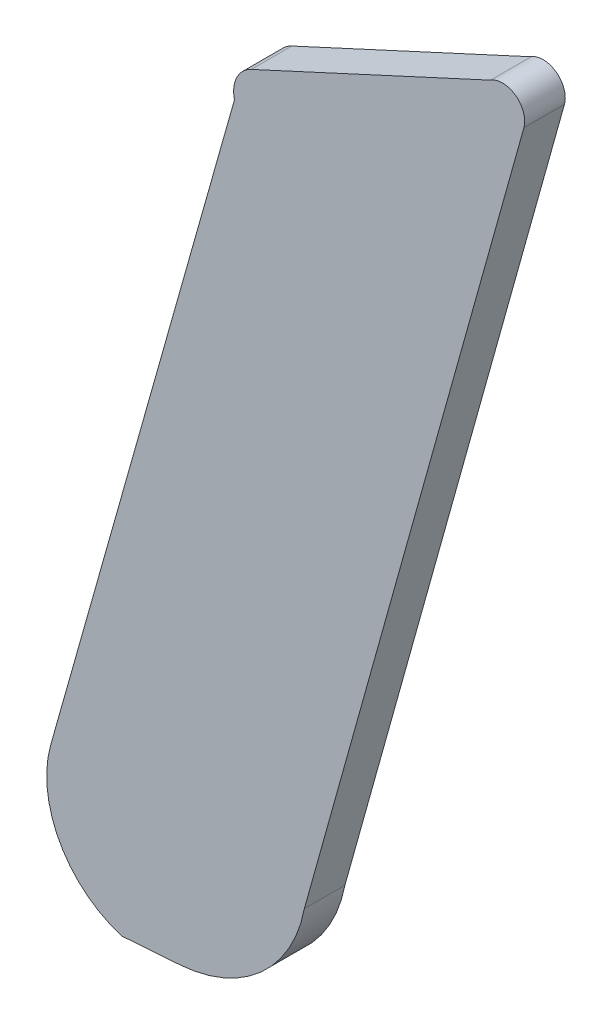
ISO-10303-21;
HEADER;
FILE_DESCRIPTION(('STEP AP214'),'2;1');
FILE_NAME('part.step','',(''),(''),'','','');
FILE_SCHEMA(('AUTOMOTIVE_DESIGN { 1 0 10303 214 1 1 1 1 }'));
ENDSEC;
DATA;
#1=APPLICATION_CONTEXT('core data for automotive mechanical design processes');
#2=APPLICATION_PROTOCOL_DEFINITION('international standard','automotive_design',2000,#1);
#3=PRODUCT_CONTEXT('',#1,'mechanical');
#4=PRODUCT('Part','Part','',(#3));
#5=PRODUCT_RELATED_PRODUCT_CATEGORY('part','',(#4));
#6=PRODUCT_DEFINITION_FORMATION('','',#4);
#7=PRODUCT_DEFINITION_CONTEXT('part definition',#1,'design');
#8=PRODUCT_DEFINITION('design','',#6,#7);
#9=PRODUCT_DEFINITION_SHAPE('','',#8);
#10=(LENGTH_UNIT() NAMED_UNIT(*) SI_UNIT(.MILLI.,.METRE.));
#11=(NAMED_UNIT(*) PLANE_ANGLE_UNIT() SI_UNIT($,.RADIAN.));
#12=(NAMED_UNIT(*) SI_UNIT($,.STERADIAN.) SOLID_ANGLE_UNIT());
#13=UNCERTAINTY_MEASURE_WITH_UNIT(LENGTH_MEASURE(1.E-05),#10,'distance_accuracy_value','');
#14=(GEOMETRIC_REPRESENTATION_CONTEXT(3) GLOBAL_UNCERTAINTY_ASSIGNED_CONTEXT((#13)) GLOBAL_UNIT_ASSIGNED_CONTEXT((#10,
#11,#12)) REPRESENTATION_CONTEXT('',''));
#15=CARTESIAN_POINT('',(0.,0.,0.));
#16=DIRECTION('',(0.,0.,1.));
#17=DIRECTION('',(1.,0.,0.));
#18=AXIS2_PLACEMENT_3D('',#15,#16,#17);
#19=CARTESIAN_POINT('',(6.038431084727,12.2047784362287,4.75));
#20=DIRECTION('',(0.,0.,1.));
#21=DIRECTION('',(1.,0.,0.));
#22=AXIS2_PLACEMENT_3D('',#19,#20,#21);
#23=PLANE('',#22);
#24=CARTESIAN_POINT('',(6.038431084727,12.2047784362287,4.75));
#25=DIRECTION('',(0.,0.,1.));
#26=DIRECTION('',(0.0711865301073405,-0.997463020833994,0.));
#27=AXIS2_PLACEMENT_3D('',#24,#25,#26);
#28=CIRCLE('',#27,0.00673939379807718);
#29=CARTESIAN_POINT('',(6.03891083878651,12.1980561401323,4.75));
#30=VERTEX_POINT('',#29);
#31=CARTESIAN_POINT('',(6.04505167684881,12.2035185994448,4.75));
#32=VERTEX_POINT('',#31);
#33=EDGE_CURVE('E11',#30,#32,#28,.T.);
#34=ORIENTED_EDGE('',*,*,#33,.F.);
#35=DIRECTION('',(0.997463020833723,0.0711865301111404,0.));
#36=VECTOR('',#35,1.);
#37=CARTESIAN_POINT('',(6.03604458106031,12.1978515822312,4.75));
#38=LINE('',#37,#36);
#39=CARTESIAN_POINT('',(6.03604458106031,12.1978515822312,4.75));
#40=VERTEX_POINT('',#39);
#41=EDGE_CURVE('E149',#40,#30,#38,.T.);
#42=ORIENTED_EDGE('',*,*,#41,.F.);
#43=CARTESIAN_POINT('',(6.03755206635366,12.2028364475582,4.75));
#44=DIRECTION('',(0.,0.,1.));
#45=DIRECTION('',(-0.962500176709444,0.271281053216564,0.));
#46=AXIS2_PLACEMENT_3D('',#43,#44,#45);
#47=CIRCLE('',#46,0.00520782048819952);
#48=CARTESIAN_POINT('',(6.0325395382135,12.2042492305852,4.75));
#49=VERTEX_POINT('',#48);
#50=EDGE_CURVE('E142',#49,#40,#47,.T.);
#51=ORIENTED_EDGE('',*,*,#50,.F.);
#52=DIRECTION('',(-0.271800434966842,-0.96235363747005,0.));
#53=VECTOR('',#52,1.);
#54=CARTESIAN_POINT('',(6.04160544540491,12.2363485492036,4.75));
#55=LINE('',#54,#53);
#56=CARTESIAN_POINT('',(6.04160544540491,12.2363485492036,4.75));
#57=VERTEX_POINT('',#56);
#58=EDGE_CURVE('E133',#57,#49,#55,.T.);
#59=ORIENTED_EDGE('',*,*,#58,.F.);
#60=CARTESIAN_POINT('',(6.04306694270849,12.2366986419914,4.75));
#61=DIRECTION('',(0.,0.,1.));
#62=DIRECTION('',(-0.418762389535386,0.908095843570828,0.));
#63=AXIS2_PLACEMENT_3D('',#60,#61,#62);
#64=CIRCLE('',#63,0.00150284374718741);
#65=CARTESIAN_POINT('',(6.0424376082698,12.2380633681518,4.75));
#66=VERTEX_POINT('',#65);
#67=EDGE_CURVE('E124',#66,#57,#64,.T.);
#68=ORIENTED_EDGE('',*,*,#67,.F.);
#69=DIRECTION('',(-0.908095843567239,-0.41876238954317,0.));
#70=VECTOR('',#69,1.);
#71=CARTESIAN_POINT('',(6.05423500751009,12.24350366075,4.75));
#72=LINE('',#71,#70);
#73=CARTESIAN_POINT('',(6.05423500751009,12.24350366075,4.75));
#74=VERTEX_POINT('',#73);
#75=EDGE_CURVE('E115',#74,#66,#72,.T.);
#76=ORIENTED_EDGE('',*,*,#75,.F.);
#77=CARTESIAN_POINT('',(6.05482943787897,12.2425869628833,4.75));
#78=DIRECTION('',(0.,0.,1.));
#79=DIRECTION('',(0.963136685559308,-0.269012499579166,0.));
#80=AXIS2_PLACEMENT_3D('',#77,#78,#79);
#81=CIRCLE('',#80,0.00109255775237746);
#82=CARTESIAN_POINT('',(6.05588172033137,12.2422930511914,4.75));
#83=VERTEX_POINT('',#82);
#84=EDGE_CURVE('E106',#83,#74,#81,.T.);
#85=ORIENTED_EDGE('',*,*,#84,.F.);
#86=DIRECTION('',(0.269012499581278,0.963136685558718,0.));
#87=VECTOR('',#86,1.);
#88=CARTESIAN_POINT('',(6.04505167684881,12.2035185994448,4.75));
#89=LINE('',#88,#87);
#90=EDGE_CURVE('E86',#32,#83,#89,.T.);
#91=ORIENTED_EDGE('',*,*,#90,.F.);
#92=EDGE_LOOP('',(#34,#42,#51,#59,#68,#76,#85,#91));
#93=FACE_BOUND('',#92,.T.);
#94=ADVANCED_FACE('F17',(#93),#23,.F.);
#95=CARTESIAN_POINT('',(6.03604458106031,12.1978515822312,4.83252449867128));
#96=DIRECTION('',(-0.0711865301113289,0.997463020833709,0.));
#97=DIRECTION('',(-0.997463020833709,-0.0711865301113289,0.));
#98=AXIS2_PLACEMENT_3D('',#95,#96,#97);
#99=PLANE('',#98);
#100=DIRECTION('',(4.44089209849914E-13,0.,-1.));
#101=VECTOR('',#100,1.);
#102=CARTESIAN_POINT('',(6.03891083878651,12.1980561401323,4.752));
#103=LINE('',#102,#101);
#104=CARTESIAN_POINT('',(6.03891083878651,12.1980561401323,4.752));
#105=VERTEX_POINT('',#104);
#106=EDGE_CURVE('E24',#105,#30,#103,.T.);
#107=ORIENTED_EDGE('',*,*,#106,.F.);
#108=DIRECTION('',(-0.997463020833767,-0.0711865301105253,3.09087742338964E-13));
#109=VECTOR('',#108,1.);
#110=CARTESIAN_POINT('',(6.03891083878651,12.1980561401323,4.752));
#111=LINE('',#110,#109);
#112=CARTESIAN_POINT('',(6.03604458106031,12.1978515822312,4.752));
#113=VERTEX_POINT('',#112);
#114=EDGE_CURVE('E99',#105,#113,#111,.T.);
#115=ORIENTED_EDGE('',*,*,#114,.T.);
#116=DIRECTION('',(-4.44089209849914E-13,-8.88178419699829E-13,-1.));
#117=VECTOR('',#116,1.);
#118=CARTESIAN_POINT('',(6.03604458106031,12.1978515822312,4.752));
#119=LINE('',#118,#117);
#120=EDGE_CURVE('E146',#113,#40,#119,.T.);
#121=ORIENTED_EDGE('',*,*,#120,.T.);
#122=ORIENTED_EDGE('',*,*,#41,.T.);
#123=EDGE_LOOP('',(#107,#115,#121,#122));
#124=FACE_BOUND('',#123,.T.);
#125=ADVANCED_FACE('F150',(#124),#99,.F.);
#126=CARTESIAN_POINT('',(6.03755206635366,12.2028364475582,4.83252449867128));
#127=DIRECTION('',(0.,0.,-1.));
#128=DIRECTION('',(-1.,0.,0.));
#129=AXIS2_PLACEMENT_3D('',#126,#127,#128);
#130=CYLINDRICAL_SURFACE('',#129,0.00520782048819952);
#131=ORIENTED_EDGE('',*,*,#120,.F.);
#132=CARTESIAN_POINT('',(6.03755206635366,12.2028364475582,4.752));
#133=DIRECTION('',(0.,0.,-1.));
#134=DIRECTION('',(-0.289465678924144,-0.957188393538589,0.));
#135=AXIS2_PLACEMENT_3D('',#132,#133,#134);
#136=CIRCLE('',#135,0.00520782048819952);
#137=CARTESIAN_POINT('',(6.0325395382135,12.2042492305852,4.752));
#138=VERTEX_POINT('',#137);
#139=EDGE_CURVE('E136',#113,#138,#136,.T.);
#140=ORIENTED_EDGE('',*,*,#139,.T.);
#141=DIRECTION('',(0.,0.,-1.));
#142=VECTOR('',#141,1.);
#143=CARTESIAN_POINT('',(6.0325395382135,12.2042492305852,4.752));
#144=LINE('',#143,#142);
#145=EDGE_CURVE('E139',#138,#49,#144,.T.);
#146=ORIENTED_EDGE('',*,*,#145,.T.);
#147=ORIENTED_EDGE('',*,*,#50,.T.);
#148=EDGE_LOOP('',(#131,#140,#146,#147));
#149=FACE_BOUND('',#148,.T.);
#150=ADVANCED_FACE('F152',(#149),#130,.T.);
#151=CARTESIAN_POINT('',(6.04160544540491,12.2363485492036,4.83252449867128));
#152=DIRECTION('',(0.962353637470054,-0.271800434966828,0.));
#153=DIRECTION('',(0.271800434966828,0.962353637470054,0.));
#154=AXIS2_PLACEMENT_3D('',#151,#152,#153);
#155=PLANE('',#154);
#156=ORIENTED_EDGE('',*,*,#145,.F.);
#157=DIRECTION('',(0.271800434966817,0.962353637470057,0.));
#158=VECTOR('',#157,1.);
#159=CARTESIAN_POINT('',(6.0325395382135,12.2042492305852,4.752));
#160=LINE('',#159,#158);
#161=CARTESIAN_POINT('',(6.04160544540491,12.2363485492036,4.752));
#162=VERTEX_POINT('',#161);
#163=EDGE_CURVE('E127',#138,#162,#160,.T.);
#164=ORIENTED_EDGE('',*,*,#163,.T.);
#165=DIRECTION('',(0.,0.,-1.));
#166=VECTOR('',#165,1.);
#167=CARTESIAN_POINT('',(6.04160544540491,12.2363485492036,4.752));
#168=LINE('',#167,#166);
#169=EDGE_CURVE('E130',#162,#57,#168,.T.);
#170=ORIENTED_EDGE('',*,*,#169,.T.);
#171=ORIENTED_EDGE('',*,*,#58,.T.);
#172=EDGE_LOOP('',(#156,#164,#170,#171));
#173=FACE_BOUND('',#172,.T.);
#174=ADVANCED_FACE('F155',(#173),#155,.F.);
#175=CARTESIAN_POINT('',(6.04306694270849,12.2366986419914,4.83252449867128));
#176=DIRECTION('',(0.,0.,-1.));
#177=DIRECTION('',(-1.,0.,0.));
#178=AXIS2_PLACEMENT_3D('',#175,#176,#177);
#179=CYLINDRICAL_SURFACE('',#178,0.00150284374718741);
#180=ORIENTED_EDGE('',*,*,#169,.F.);
#181=CARTESIAN_POINT('',(6.04306694270849,12.2366986419914,4.752));
#182=DIRECTION('',(0.,0.,-1.));
#183=DIRECTION('',(-0.972487862641351,-0.232953551196923,0.));
#184=AXIS2_PLACEMENT_3D('',#181,#182,#183);
#185=CIRCLE('',#184,0.00150284374718741);
#186=CARTESIAN_POINT('',(6.0424376082698,12.2380633681518,4.752));
#187=VERTEX_POINT('',#186);
#188=EDGE_CURVE('E118',#162,#187,#185,.T.);
#189=ORIENTED_EDGE('',*,*,#188,.T.);
#190=DIRECTION('',(0.,-8.88178419699829E-13,-1.));
#191=VECTOR('',#190,1.);
#192=CARTESIAN_POINT('',(6.0424376082698,12.2380633681518,4.752));
#193=LINE('',#192,#191);
#194=EDGE_CURVE('E121',#187,#66,#193,.T.);
#195=ORIENTED_EDGE('',*,*,#194,.T.);
#196=ORIENTED_EDGE('',*,*,#67,.T.);
#197=EDGE_LOOP('',(#180,#189,#195,#196));
#198=FACE_BOUND('',#197,.T.);
#199=ADVANCED_FACE('F158',(#198),#179,.T.);
#200=CARTESIAN_POINT('',(6.05423500751009,12.24350366075,4.83252449867128));
#201=DIRECTION('',(0.418762389543199,-0.908095843567225,0.));
#202=DIRECTION('',(0.908095843567225,0.418762389543199,0.));
#203=AXIS2_PLACEMENT_3D('',#200,#201,#202);
#204=PLANE('',#203);
#205=ORIENTED_EDGE('',*,*,#194,.F.);
#206=DIRECTION('',(0.908095843567227,0.418762389543196,0.));
#207=VECTOR('',#206,1.);
#208=CARTESIAN_POINT('',(6.04243760826982,12.2380633681518,4.752));
#209=LINE('',#208,#207);
#210=CARTESIAN_POINT('',(6.05423500751009,12.24350366075,4.752));
#211=VERTEX_POINT('',#210);
#212=EDGE_CURVE('E109',#187,#211,#209,.T.);
#213=ORIENTED_EDGE('',*,*,#212,.T.);
#214=DIRECTION('',(0.,8.88178419699829E-13,-1.));
#215=VECTOR('',#214,1.);
#216=CARTESIAN_POINT('',(6.05423500751009,12.24350366075,4.752));
#217=LINE('',#216,#215);
#218=EDGE_CURVE('E112',#211,#74,#217,.T.);
#219=ORIENTED_EDGE('',*,*,#218,.T.);
#220=ORIENTED_EDGE('',*,*,#75,.T.);
#221=EDGE_LOOP('',(#205,#213,#219,#220));
#222=FACE_BOUND('',#221,.T.);
#223=ADVANCED_FACE('F160',(#222),#204,.F.);
#224=CARTESIAN_POINT('',(6.05482943787897,12.2425869628833,4.83252449867128));
#225=DIRECTION('',(0.,0.,-1.));
#226=DIRECTION('',(0.59232417255486,0.805699742216168,0.));
#227=AXIS2_PLACEMENT_3D('',#224,#225,#226);
#228=CYLINDRICAL_SURFACE('',#227,0.00109255775237746);
#229=ORIENTED_EDGE('',*,*,#218,.F.);
#230=CARTESIAN_POINT('',(6.05482943787897,12.2425869628833,4.752));
#231=DIRECTION('',(0.,0.,-1.));
#232=DIRECTION('',(-0.544072263083496,0.839038361782823,0.));
#233=AXIS2_PLACEMENT_3D('',#230,#231,#232);
#234=CIRCLE('',#233,0.00109255775237746);
#235=CARTESIAN_POINT('',(6.05588172033137,12.2422930511914,4.752));
#236=VERTEX_POINT('',#235);
#237=EDGE_CURVE('E103',#211,#236,#234,.T.);
#238=ORIENTED_EDGE('',*,*,#237,.T.);
#239=DIRECTION('',(4.44089209849914E-13,0.,-1.));
#240=VECTOR('',#239,1.);
#241=CARTESIAN_POINT('',(6.05588172033137,12.2422930511914,4.752));
#242=LINE('',#241,#240);
#243=EDGE_CURVE('E92',#236,#83,#242,.T.);
#244=ORIENTED_EDGE('',*,*,#243,.T.);
#245=ORIENTED_EDGE('',*,*,#84,.T.);
#246=EDGE_LOOP('',(#229,#238,#244,#245));
#247=FACE_BOUND('',#246,.T.);
#248=ADVANCED_FACE('F163',(#247),#228,.T.);
#249=CARTESIAN_POINT('',(6.04505167684881,12.2035185994448,4.83252449867128));
#250=DIRECTION('',(-0.963136685558715,0.269012499581289,0.));
#251=DIRECTION('',(-0.269012499581289,-0.963136685558715,0.));
#252=AXIS2_PLACEMENT_3D('',#249,#250,#251);
#253=PLANE('',#252);
#254=ORIENTED_EDGE('',*,*,#243,.F.);
#255=DIRECTION('',(-0.269012499581287,-0.963136685558716,0.));
#256=VECTOR('',#255,1.);
#257=CARTESIAN_POINT('',(6.05588172033137,12.2422930511914,4.752));
#258=LINE('',#257,#256);
#259=CARTESIAN_POINT('',(6.04505167684881,12.2035185994448,4.752));
#260=VERTEX_POINT('',#259);
#261=EDGE_CURVE('E87',#236,#260,#258,.T.);
#262=ORIENTED_EDGE('',*,*,#261,.T.);
#263=DIRECTION('',(0.,0.,-1.));
#264=VECTOR('',#263,1.);
#265=CARTESIAN_POINT('',(6.04505167684881,12.2035185994448,4.752));
#266=LINE('',#265,#264);
#267=EDGE_CURVE('E78',#260,#32,#266,.T.);
#268=ORIENTED_EDGE('',*,*,#267,.T.);
#269=ORIENTED_EDGE('',*,*,#90,.T.);
#270=EDGE_LOOP('',(#254,#262,#268,#269));
#271=FACE_BOUND('',#270,.T.);
#272=ADVANCED_FACE('F90',(#271),#253,.F.);
#273=CARTESIAN_POINT('',(6.038431084727,12.2047784362287,4.83252449867128));
#274=DIRECTION('',(0.,0.,-1.));
#275=DIRECTION('',(-1.,0.,0.));
#276=AXIS2_PLACEMENT_3D('',#273,#274,#275);
#277=CYLINDRICAL_SURFACE('',#276,0.00673939379807718);
#278=ORIENTED_EDGE('',*,*,#267,.F.);
#279=CARTESIAN_POINT('',(6.038431084727,12.2047784362287,4.752));
#280=DIRECTION('',(0.,0.,-1.));
#281=DIRECTION('',(0.982372053063247,-0.186936217358489,0.));
#282=AXIS2_PLACEMENT_3D('',#279,#280,#281);
#283=CIRCLE('',#282,0.00673939379807718);
#284=EDGE_CURVE('E82',#260,#105,#283,.T.);
#285=ORIENTED_EDGE('',*,*,#284,.T.);
#286=ORIENTED_EDGE('',*,*,#106,.T.);
#287=ORIENTED_EDGE('',*,*,#33,.T.);
#288=EDGE_LOOP('',(#278,#285,#286,#287));
#289=FACE_BOUND('',#288,.T.);
#290=ADVANCED_FACE('F80',(#289),#277,.T.);
#291=CARTESIAN_POINT('',(5.86959286961936,12.1314924009898,4.752));
#292=DIRECTION('',(0.,0.,-1.));
#293=DIRECTION('',(-1.,0.,0.));
#294=AXIS2_PLACEMENT_3D('',#291,#292,#293);
#295=PLANE('',#294);
#296=ORIENTED_EDGE('',*,*,#261,.F.);
#297=ORIENTED_EDGE('',*,*,#237,.F.);
#298=ORIENTED_EDGE('',*,*,#212,.F.);
#299=ORIENTED_EDGE('',*,*,#188,.F.);
#300=ORIENTED_EDGE('',*,*,#163,.F.);
#301=ORIENTED_EDGE('',*,*,#139,.F.);
#302=ORIENTED_EDGE('',*,*,#114,.F.);
#303=ORIENTED_EDGE('',*,*,#284,.F.);
#304=EDGE_LOOP('',(#296,#297,#298,#299,#300,#301,#302,#303));
#305=FACE_BOUND('',#304,.T.);
#306=ADVANCED_FACE('F97',(#305),#295,.F.);
#307=CLOSED_SHELL('',(#94,#125,#150,#174,#199,#223,#248,#272,#290,#306));
#308=MANIFOLD_SOLID_BREP('B1',#307);
#309=ADVANCED_BREP_SHAPE_REPRESENTATION('',(#18,#308),#14);
#310=SHAPE_DEFINITION_REPRESENTATION(#9,#309);
ENDSEC;
END-ISO-10303-21;
